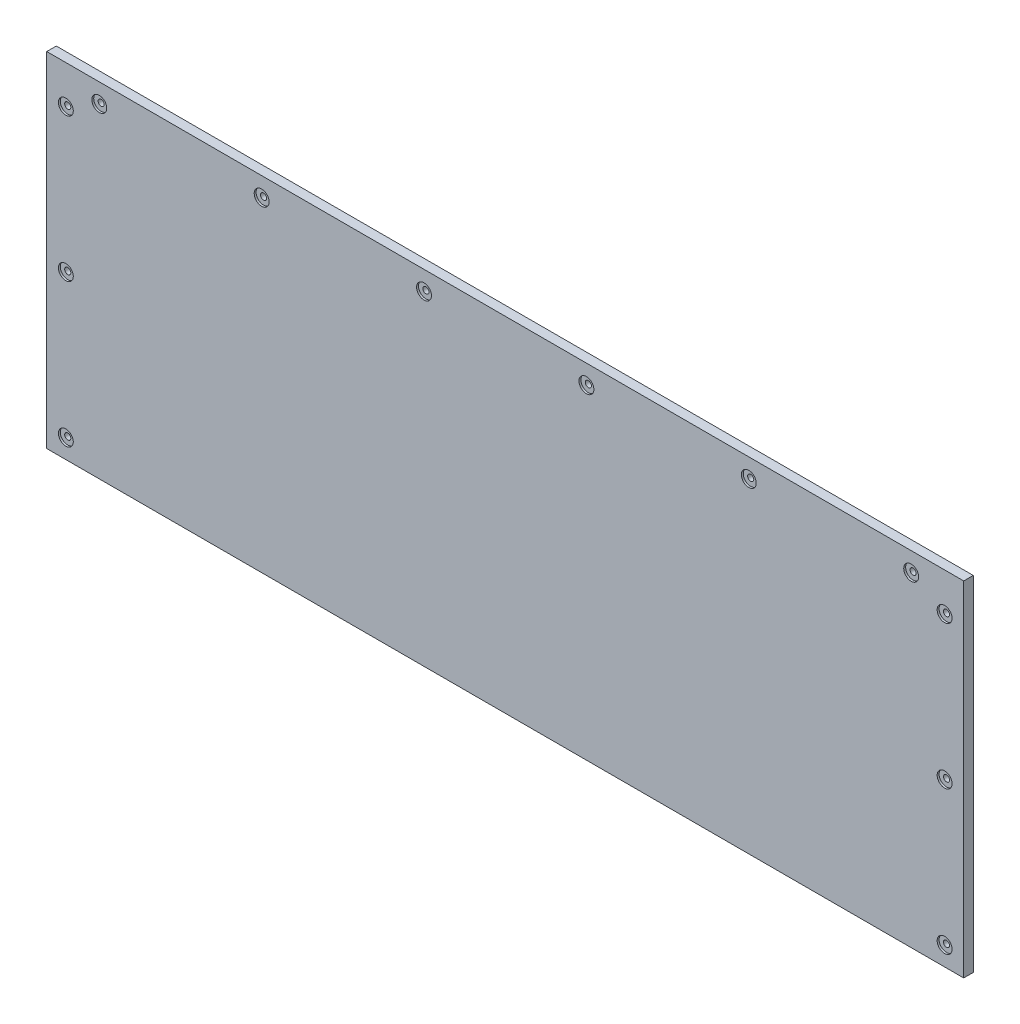
ISO-10303-21;
HEADER;
FILE_DESCRIPTION(('STEP AP214'),'2;1');
FILE_NAME('part.step','',(''),(''),'','','');
FILE_SCHEMA(('AUTOMOTIVE_DESIGN { 1 0 10303 214 1 1 1 1 }'));
ENDSEC;
DATA;
#1=APPLICATION_CONTEXT('core data for automotive mechanical design processes');
#2=APPLICATION_PROTOCOL_DEFINITION('international standard','automotive_design',2000,#1);
#3=PRODUCT_CONTEXT('',#1,'mechanical');
#4=PRODUCT('Part','Part','',(#3));
#5=PRODUCT_RELATED_PRODUCT_CATEGORY('part','',(#4));
#6=PRODUCT_DEFINITION_FORMATION('','',#4);
#7=PRODUCT_DEFINITION_CONTEXT('part definition',#1,'design');
#8=PRODUCT_DEFINITION('design','',#6,#7);
#9=PRODUCT_DEFINITION_SHAPE('','',#8);
#10=(LENGTH_UNIT() NAMED_UNIT(*) SI_UNIT(.MILLI.,.METRE.));
#11=(NAMED_UNIT(*) PLANE_ANGLE_UNIT() SI_UNIT($,.RADIAN.));
#12=(NAMED_UNIT(*) SI_UNIT($,.STERADIAN.) SOLID_ANGLE_UNIT());
#13=UNCERTAINTY_MEASURE_WITH_UNIT(LENGTH_MEASURE(1.E-05),#10,'distance_accuracy_value','');
#14=(GEOMETRIC_REPRESENTATION_CONTEXT(3) GLOBAL_UNCERTAINTY_ASSIGNED_CONTEXT((#13)) GLOBAL_UNIT_ASSIGNED_CONTEXT((#10,
#11,#12)) REPRESENTATION_CONTEXT('',''));
#15=CARTESIAN_POINT('',(0.,0.,0.));
#16=DIRECTION('',(0.,0.,1.));
#17=DIRECTION('',(1.,0.,0.));
#18=AXIS2_PLACEMENT_3D('',#15,#16,#17);
#19=CARTESIAN_POINT('',(574.675,215.9,0.));
#20=DIRECTION('',(0.,0.,1.));
#21=DIRECTION('',(1.,0.,0.));
#22=AXIS2_PLACEMENT_3D('',#19,#20,#21);
#23=CYLINDRICAL_SURFACE('',#22,2.03200000000001);
#24=CARTESIAN_POINT('',(574.675,215.9,0.));
#25=DIRECTION('',(0.,0.,1.));
#26=DIRECTION('',(1.,0.,0.));
#27=AXIS2_PLACEMENT_3D('',#24,#25,#26);
#28=CIRCLE('',#27,2.03200000000001);
#29=CARTESIAN_POINT('',(576.707,215.9,0.));
#30=VERTEX_POINT('',#29);
#31=EDGE_CURVE('E151',#30,#30,#28,.T.);
#32=ORIENTED_EDGE('',*,*,#31,.F.);
#33=EDGE_LOOP('',(#32));
#34=FACE_BOUND('',#33,.T.);
#35=CARTESIAN_POINT('',(574.675,215.9,5.08));
#36=DIRECTION('',(0.,0.,1.));
#37=DIRECTION('',(1.,0.,0.));
#38=AXIS2_PLACEMENT_3D('',#35,#36,#37);
#39=CIRCLE('',#38,2.03200000000001);
#40=CARTESIAN_POINT('',(576.707,215.9,5.08));
#41=VERTEX_POINT('',#40);
#42=EDGE_CURVE('E40',#41,#41,#39,.F.);
#43=ORIENTED_EDGE('',*,*,#42,.F.);
#44=EDGE_LOOP('',(#43));
#45=FACE_BOUND('',#44,.T.);
#46=ADVANCED_FACE('F36',(#34,#45),#23,.F.);
#47=CARTESIAN_POINT('',(466.725,215.9,0.));
#48=DIRECTION('',(0.,0.,1.));
#49=DIRECTION('',(1.,0.,0.));
#50=AXIS2_PLACEMENT_3D('',#47,#48,#49);
#51=CYLINDRICAL_SURFACE('',#50,2.03199999999995);
#52=CARTESIAN_POINT('',(466.725,215.9,0.));
#53=DIRECTION('',(0.,0.,1.));
#54=DIRECTION('',(1.,0.,0.));
#55=AXIS2_PLACEMENT_3D('',#52,#53,#54);
#56=CIRCLE('',#55,2.03199999999995);
#57=CARTESIAN_POINT('',(468.757,215.9,0.));
#58=VERTEX_POINT('',#57);
#59=EDGE_CURVE('E155',#58,#58,#56,.T.);
#60=ORIENTED_EDGE('',*,*,#59,.F.);
#61=EDGE_LOOP('',(#60));
#62=FACE_BOUND('',#61,.T.);
#63=CARTESIAN_POINT('',(466.725,215.9,5.08));
#64=DIRECTION('',(0.,0.,1.));
#65=DIRECTION('',(1.,0.,0.));
#66=AXIS2_PLACEMENT_3D('',#63,#64,#65);
#67=CIRCLE('',#66,2.03199999999995);
#68=CARTESIAN_POINT('',(468.757,215.9,5.08));
#69=VERTEX_POINT('',#68);
#70=EDGE_CURVE('E146',#69,#69,#67,.F.);
#71=ORIENTED_EDGE('',*,*,#70,.F.);
#72=EDGE_LOOP('',(#71));
#73=FACE_BOUND('',#72,.T.);
#74=ADVANCED_FACE('F246',(#62,#73),#51,.F.);
#75=CARTESIAN_POINT('',(358.775,215.9,0.));
#76=DIRECTION('',(0.,0.,1.));
#77=DIRECTION('',(1.,0.,0.));
#78=AXIS2_PLACEMENT_3D('',#75,#76,#77);
#79=CYLINDRICAL_SURFACE('',#78,2.03199999999995);
#80=CARTESIAN_POINT('',(358.775,215.9,0.));
#81=DIRECTION('',(0.,0.,1.));
#82=DIRECTION('',(1.,0.,0.));
#83=AXIS2_PLACEMENT_3D('',#80,#81,#82);
#84=CIRCLE('',#83,2.03199999999995);
#85=CARTESIAN_POINT('',(360.807,215.9,0.));
#86=VERTEX_POINT('',#85);
#87=EDGE_CURVE('E160',#86,#86,#84,.T.);
#88=ORIENTED_EDGE('',*,*,#87,.F.);
#89=EDGE_LOOP('',(#88));
#90=FACE_BOUND('',#89,.T.);
#91=CARTESIAN_POINT('',(358.775,215.9,5.08));
#92=DIRECTION('',(0.,0.,1.));
#93=DIRECTION('',(1.,0.,0.));
#94=AXIS2_PLACEMENT_3D('',#91,#92,#93);
#95=CIRCLE('',#94,2.03199999999995);
#96=CARTESIAN_POINT('',(360.807,215.9,5.08));
#97=VERTEX_POINT('',#96);
#98=EDGE_CURVE('E144',#97,#97,#95,.F.);
#99=ORIENTED_EDGE('',*,*,#98,.F.);
#100=EDGE_LOOP('',(#99));
#101=FACE_BOUND('',#100,.T.);
#102=ADVANCED_FACE('F252',(#90,#101),#79,.F.);
#103=CARTESIAN_POINT('',(250.825,215.9,0.));
#104=DIRECTION('',(0.,0.,1.));
#105=DIRECTION('',(1.,0.,0.));
#106=AXIS2_PLACEMENT_3D('',#103,#104,#105);
#107=CYLINDRICAL_SURFACE('',#106,2.03199999999995);
#108=CARTESIAN_POINT('',(250.825,215.9,0.));
#109=DIRECTION('',(0.,0.,1.));
#110=DIRECTION('',(1.,0.,0.));
#111=AXIS2_PLACEMENT_3D('',#108,#109,#110);
#112=CIRCLE('',#111,2.03199999999995);
#113=CARTESIAN_POINT('',(252.857,215.9,0.));
#114=VERTEX_POINT('',#113);
#115=EDGE_CURVE('E660',#114,#114,#112,.T.);
#116=ORIENTED_EDGE('',*,*,#115,.F.);
#117=EDGE_LOOP('',(#116));
#118=FACE_BOUND('',#117,.T.);
#119=CARTESIAN_POINT('',(250.825,215.9,5.08));
#120=DIRECTION('',(0.,0.,1.));
#121=DIRECTION('',(1.,0.,0.));
#122=AXIS2_PLACEMENT_3D('',#119,#120,#121);
#123=CIRCLE('',#122,2.03199999999995);
#124=CARTESIAN_POINT('',(252.857,215.9,5.08));
#125=VERTEX_POINT('',#124);
#126=EDGE_CURVE('E141',#125,#125,#123,.F.);
#127=ORIENTED_EDGE('',*,*,#126,.F.);
#128=EDGE_LOOP('',(#127));
#129=FACE_BOUND('',#128,.T.);
#130=ADVANCED_FACE('F492',(#118,#129),#107,.F.);
#131=CARTESIAN_POINT('',(142.875,215.9,0.));
#132=DIRECTION('',(0.,0.,1.));
#133=DIRECTION('',(1.,0.,0.));
#134=AXIS2_PLACEMENT_3D('',#131,#132,#133);
#135=CYLINDRICAL_SURFACE('',#134,2.032);
#136=CARTESIAN_POINT('',(142.875,215.9,0.));
#137=DIRECTION('',(0.,0.,1.));
#138=DIRECTION('',(1.,0.,0.));
#139=AXIS2_PLACEMENT_3D('',#136,#137,#138);
#140=CIRCLE('',#139,2.032);
#141=CARTESIAN_POINT('',(144.907,215.9,0.));
#142=VERTEX_POINT('',#141);
#143=EDGE_CURVE('E657',#142,#142,#140,.T.);
#144=ORIENTED_EDGE('',*,*,#143,.F.);
#145=EDGE_LOOP('',(#144));
#146=FACE_BOUND('',#145,.T.);
#147=CARTESIAN_POINT('',(142.875,215.9,5.08));
#148=DIRECTION('',(0.,0.,1.));
#149=DIRECTION('',(1.,0.,0.));
#150=AXIS2_PLACEMENT_3D('',#147,#148,#149);
#151=CIRCLE('',#150,2.032);
#152=CARTESIAN_POINT('',(144.907,215.9,5.08));
#153=VERTEX_POINT('',#152);
#154=EDGE_CURVE('E137',#153,#153,#151,.F.);
#155=ORIENTED_EDGE('',*,*,#154,.F.);
#156=EDGE_LOOP('',(#155));
#157=FACE_BOUND('',#156,.T.);
#158=ADVANCED_FACE('F501',(#146,#157),#135,.F.);
#159=CARTESIAN_POINT('',(34.925,215.9,0.));
#160=DIRECTION('',(0.,0.,1.));
#161=DIRECTION('',(1.,0.,0.));
#162=AXIS2_PLACEMENT_3D('',#159,#160,#161);
#163=CYLINDRICAL_SURFACE('',#162,2.032);
#164=CARTESIAN_POINT('',(34.925,215.9,0.));
#165=DIRECTION('',(0.,0.,1.));
#166=DIRECTION('',(1.,0.,0.));
#167=AXIS2_PLACEMENT_3D('',#164,#165,#166);
#168=CIRCLE('',#167,2.032);
#169=CARTESIAN_POINT('',(36.957,215.9,0.));
#170=VERTEX_POINT('',#169);
#171=EDGE_CURVE('E195',#170,#170,#168,.T.);
#172=ORIENTED_EDGE('',*,*,#171,.F.);
#173=EDGE_LOOP('',(#172));
#174=FACE_BOUND('',#173,.T.);
#175=CARTESIAN_POINT('',(34.925,215.9,5.08));
#176=DIRECTION('',(0.,0.,1.));
#177=DIRECTION('',(1.,0.,0.));
#178=AXIS2_PLACEMENT_3D('',#175,#176,#177);
#179=CIRCLE('',#178,2.032);
#180=CARTESIAN_POINT('',(36.957,215.9,5.08));
#181=VERTEX_POINT('',#180);
#182=EDGE_CURVE('E134',#181,#181,#179,.F.);
#183=ORIENTED_EDGE('',*,*,#182,.F.);
#184=EDGE_LOOP('',(#183));
#185=FACE_BOUND('',#184,.T.);
#186=ADVANCED_FACE('F224',(#174,#185),#163,.F.);
#187=CARTESIAN_POINT('',(12.7,203.2,0.));
#188=DIRECTION('',(0.,0.,1.));
#189=DIRECTION('',(1.,0.,0.));
#190=AXIS2_PLACEMENT_3D('',#187,#188,#189);
#191=CYLINDRICAL_SURFACE('',#190,2.032);
#192=CARTESIAN_POINT('',(12.7,203.2,0.));
#193=DIRECTION('',(0.,0.,1.));
#194=DIRECTION('',(1.,0.,0.));
#195=AXIS2_PLACEMENT_3D('',#192,#193,#194);
#196=CIRCLE('',#195,2.032);
#197=CARTESIAN_POINT('',(14.732,203.2,0.));
#198=VERTEX_POINT('',#197);
#199=EDGE_CURVE('E105',#198,#198,#196,.T.);
#200=ORIENTED_EDGE('',*,*,#199,.F.);
#201=EDGE_LOOP('',(#200));
#202=FACE_BOUND('',#201,.T.);
#203=CARTESIAN_POINT('',(12.7,203.2,5.08));
#204=DIRECTION('',(0.,0.,1.));
#205=DIRECTION('',(1.,0.,0.));
#206=AXIS2_PLACEMENT_3D('',#203,#204,#205);
#207=CIRCLE('',#206,2.032);
#208=CARTESIAN_POINT('',(14.732,203.2,5.08));
#209=VERTEX_POINT('',#208);
#210=EDGE_CURVE('E130',#209,#209,#207,.F.);
#211=ORIENTED_EDGE('',*,*,#210,.F.);
#212=EDGE_LOOP('',(#211));
#213=FACE_BOUND('',#212,.T.);
#214=ADVANCED_FACE('F220',(#202,#213),#191,.F.);
#215=CARTESIAN_POINT('',(12.700000000001,107.95,0.));
#216=DIRECTION('',(0.,0.,1.));
#217=DIRECTION('',(1.,0.,0.));
#218=AXIS2_PLACEMENT_3D('',#215,#216,#217);
#219=CYLINDRICAL_SURFACE('',#218,2.032);
#220=CARTESIAN_POINT('',(12.700000000001,107.95,0.));
#221=DIRECTION('',(0.,0.,1.));
#222=DIRECTION('',(1.,0.,0.));
#223=AXIS2_PLACEMENT_3D('',#220,#221,#222);
#224=CIRCLE('',#223,2.032);
#225=CARTESIAN_POINT('',(14.732000000001,107.95,0.));
#226=VERTEX_POINT('',#225);
#227=EDGE_CURVE('E200',#226,#226,#224,.T.);
#228=ORIENTED_EDGE('',*,*,#227,.F.);
#229=EDGE_LOOP('',(#228));
#230=FACE_BOUND('',#229,.T.);
#231=CARTESIAN_POINT('',(12.700000000001,107.95,5.08));
#232=DIRECTION('',(0.,0.,1.));
#233=DIRECTION('',(1.,0.,0.));
#234=AXIS2_PLACEMENT_3D('',#231,#232,#233);
#235=CIRCLE('',#234,2.032);
#236=CARTESIAN_POINT('',(14.732000000001,107.95,5.08));
#237=VERTEX_POINT('',#236);
#238=EDGE_CURVE('E127',#237,#237,#235,.F.);
#239=ORIENTED_EDGE('',*,*,#238,.F.);
#240=EDGE_LOOP('',(#239));
#241=FACE_BOUND('',#240,.T.);
#242=ADVANCED_FACE('F223',(#230,#241),#219,.F.);
#243=CARTESIAN_POINT('',(12.700000000002,12.7,0.));
#244=DIRECTION('',(0.,0.,1.));
#245=DIRECTION('',(1.,0.,0.));
#246=AXIS2_PLACEMENT_3D('',#243,#244,#245);
#247=CYLINDRICAL_SURFACE('',#246,2.032);
#248=CARTESIAN_POINT('',(12.700000000002,12.7,0.));
#249=DIRECTION('',(0.,0.,1.));
#250=DIRECTION('',(1.,0.,0.));
#251=AXIS2_PLACEMENT_3D('',#248,#249,#250);
#252=CIRCLE('',#251,2.032);
#253=CARTESIAN_POINT('',(14.732000000002,12.7,0.));
#254=VERTEX_POINT('',#253);
#255=EDGE_CURVE('E203',#254,#254,#252,.T.);
#256=ORIENTED_EDGE('',*,*,#255,.F.);
#257=EDGE_LOOP('',(#256));
#258=FACE_BOUND('',#257,.T.);
#259=CARTESIAN_POINT('',(12.700000000002,12.7,5.08));
#260=DIRECTION('',(0.,0.,1.));
#261=DIRECTION('',(1.,0.,0.));
#262=AXIS2_PLACEMENT_3D('',#259,#260,#261);
#263=CIRCLE('',#262,2.032);
#264=CARTESIAN_POINT('',(14.732000000002,12.7,5.08));
#265=VERTEX_POINT('',#264);
#266=EDGE_CURVE('E124',#265,#265,#263,.F.);
#267=ORIENTED_EDGE('',*,*,#266,.F.);
#268=EDGE_LOOP('',(#267));
#269=FACE_BOUND('',#268,.T.);
#270=ADVANCED_FACE('F304',(#258,#269),#247,.F.);
#271=CARTESIAN_POINT('',(0.,0.,6.35));
#272=DIRECTION('',(0.,0.,1.));
#273=DIRECTION('',(1.,0.,0.));
#274=AXIS2_PLACEMENT_3D('',#271,#272,#273);
#275=PLANE('',#274);
#276=CARTESIAN_POINT('',(34.925,215.9,6.35));
#277=DIRECTION('',(0.,0.,1.));
#278=DIRECTION('',(1.,0.,0.));
#279=AXIS2_PLACEMENT_3D('',#276,#277,#278);
#280=CIRCLE('',#279,4.953);
#281=CARTESIAN_POINT('',(39.878,215.9,6.35));
#282=VERTEX_POINT('',#281);
#283=EDGE_CURVE('E713',#282,#282,#280,.T.);
#284=ORIENTED_EDGE('',*,*,#283,.F.);
#285=EDGE_LOOP('',(#284));
#286=FACE_BOUND('',#285,.T.);
#287=CARTESIAN_POINT('',(142.875,215.9,6.35));
#288=DIRECTION('',(0.,0.,1.));
#289=DIRECTION('',(1.,0.,0.));
#290=AXIS2_PLACEMENT_3D('',#287,#288,#289);
#291=CIRCLE('',#290,4.953);
#292=CARTESIAN_POINT('',(147.828,215.9,6.35));
#293=VERTEX_POINT('',#292);
#294=EDGE_CURVE('E707',#293,#293,#291,.T.);
#295=ORIENTED_EDGE('',*,*,#294,.F.);
#296=EDGE_LOOP('',(#295));
#297=FACE_BOUND('',#296,.T.);
#298=CARTESIAN_POINT('',(250.825,215.9,6.35));
#299=DIRECTION('',(0.,0.,1.));
#300=DIRECTION('',(1.,0.,0.));
#301=AXIS2_PLACEMENT_3D('',#298,#299,#300);
#302=CIRCLE('',#301,4.95299999999995);
#303=CARTESIAN_POINT('',(255.778,215.9,6.35));
#304=VERTEX_POINT('',#303);
#305=EDGE_CURVE('E701',#304,#304,#302,.T.);
#306=ORIENTED_EDGE('',*,*,#305,.F.);
#307=EDGE_LOOP('',(#306));
#308=FACE_BOUND('',#307,.T.);
#309=CARTESIAN_POINT('',(358.775,215.9,6.35));
#310=DIRECTION('',(0.,0.,1.));
#311=DIRECTION('',(1.,0.,0.));
#312=AXIS2_PLACEMENT_3D('',#309,#310,#311);
#313=CIRCLE('',#312,4.95299999999995);
#314=CARTESIAN_POINT('',(363.728,215.9,6.35));
#315=VERTEX_POINT('',#314);
#316=EDGE_CURVE('E695',#315,#315,#313,.T.);
#317=ORIENTED_EDGE('',*,*,#316,.F.);
#318=EDGE_LOOP('',(#317));
#319=FACE_BOUND('',#318,.T.);
#320=CARTESIAN_POINT('',(466.725,215.9,6.35));
#321=DIRECTION('',(0.,0.,1.));
#322=DIRECTION('',(1.,0.,0.));
#323=AXIS2_PLACEMENT_3D('',#320,#321,#322);
#324=CIRCLE('',#323,4.95299999999995);
#325=CARTESIAN_POINT('',(471.678,215.9,6.35));
#326=VERTEX_POINT('',#325);
#327=EDGE_CURVE('E651',#326,#326,#324,.T.);
#328=ORIENTED_EDGE('',*,*,#327,.F.);
#329=EDGE_LOOP('',(#328));
#330=FACE_BOUND('',#329,.T.);
#331=CARTESIAN_POINT('',(574.675,215.9,6.35));
#332=DIRECTION('',(0.,0.,1.));
#333=DIRECTION('',(1.,0.,0.));
#334=AXIS2_PLACEMENT_3D('',#331,#332,#333);
#335=CIRCLE('',#334,4.95299999999995);
#336=CARTESIAN_POINT('',(579.628,215.9,6.35));
#337=VERTEX_POINT('',#336);
#338=EDGE_CURVE('E648',#337,#337,#335,.T.);
#339=ORIENTED_EDGE('',*,*,#338,.F.);
#340=EDGE_LOOP('',(#339));
#341=FACE_BOUND('',#340,.T.);
#342=CARTESIAN_POINT('',(596.9,203.2,6.35));
#343=DIRECTION('',(0.,0.,1.));
#344=DIRECTION('',(-1.,0.,0.));
#345=AXIS2_PLACEMENT_3D('',#342,#343,#344);
#346=CIRCLE('',#345,4.95300000000006);
#347=CARTESIAN_POINT('',(591.947,203.2,6.35));
#348=VERTEX_POINT('',#347);
#349=EDGE_CURVE('E192',#348,#348,#346,.T.);
#350=ORIENTED_EDGE('',*,*,#349,.F.);
#351=EDGE_LOOP('',(#350));
#352=FACE_BOUND('',#351,.T.);
#353=CARTESIAN_POINT('',(596.899999999999,107.95,6.35));
#354=DIRECTION('',(0.,0.,1.));
#355=DIRECTION('',(-1.,0.,0.));
#356=AXIS2_PLACEMENT_3D('',#353,#354,#355);
#357=CIRCLE('',#356,4.95300000000006);
#358=CARTESIAN_POINT('',(591.946999999999,107.95,6.35));
#359=VERTEX_POINT('',#358);
#360=EDGE_CURVE('E186',#359,#359,#357,.T.);
#361=ORIENTED_EDGE('',*,*,#360,.F.);
#362=EDGE_LOOP('',(#361));
#363=FACE_BOUND('',#362,.T.);
#364=CARTESIAN_POINT('',(596.899999999998,12.7,6.35));
#365=DIRECTION('',(0.,0.,1.));
#366=DIRECTION('',(-1.,0.,0.));
#367=AXIS2_PLACEMENT_3D('',#364,#365,#366);
#368=CIRCLE('',#367,4.95300000000006);
#369=CARTESIAN_POINT('',(591.946999999998,12.7,6.35));
#370=VERTEX_POINT('',#369);
#371=EDGE_CURVE('E180',#370,#370,#368,.T.);
#372=ORIENTED_EDGE('',*,*,#371,.F.);
#373=EDGE_LOOP('',(#372));
#374=FACE_BOUND('',#373,.T.);
#375=CARTESIAN_POINT('',(12.700000000002,12.7,6.35));
#376=DIRECTION('',(0.,0.,1.));
#377=DIRECTION('',(1.,0.,0.));
#378=AXIS2_PLACEMENT_3D('',#375,#376,#377);
#379=CIRCLE('',#378,4.953);
#380=CARTESIAN_POINT('',(17.653000000002,12.7,6.35));
#381=VERTEX_POINT('',#380);
#382=EDGE_CURVE('E174',#381,#381,#379,.T.);
#383=ORIENTED_EDGE('',*,*,#382,.F.);
#384=EDGE_LOOP('',(#383));
#385=FACE_BOUND('',#384,.T.);
#386=CARTESIAN_POINT('',(12.700000000001,107.95,6.35));
#387=DIRECTION('',(0.,0.,1.));
#388=DIRECTION('',(1.,0.,0.));
#389=AXIS2_PLACEMENT_3D('',#386,#387,#388);
#390=CIRCLE('',#389,4.953);
#391=CARTESIAN_POINT('',(17.653000000001,107.95,6.35));
#392=VERTEX_POINT('',#391);
#393=EDGE_CURVE('E168',#392,#392,#390,.T.);
#394=ORIENTED_EDGE('',*,*,#393,.F.);
#395=EDGE_LOOP('',(#394));
#396=FACE_BOUND('',#395,.T.);
#397=CARTESIAN_POINT('',(12.7,203.2,6.35));
#398=DIRECTION('',(0.,0.,1.));
#399=DIRECTION('',(1.,0.,0.));
#400=AXIS2_PLACEMENT_3D('',#397,#398,#399);
#401=CIRCLE('',#400,4.953);
#402=CARTESIAN_POINT('',(17.653,203.2,6.35));
#403=VERTEX_POINT('',#402);
#404=EDGE_CURVE('E167',#403,#403,#401,.T.);
#405=ORIENTED_EDGE('',*,*,#404,.F.);
#406=EDGE_LOOP('',(#405));
#407=FACE_BOUND('',#406,.T.);
#408=DIRECTION('',(1.,0.,0.));
#409=VECTOR('',#408,1.);
#410=CARTESIAN_POINT('',(0.,0.,6.35));
#411=LINE('',#410,#409);
#412=CARTESIAN_POINT('',(0.,0.,6.35));
#413=VERTEX_POINT('',#412);
#414=CARTESIAN_POINT('',(609.6,0.,6.35));
#415=VERTEX_POINT('',#414);
#416=EDGE_CURVE('E88',#413,#415,#411,.T.);
#417=ORIENTED_EDGE('',*,*,#416,.T.);
#418=DIRECTION('',(0.,1.,0.));
#419=VECTOR('',#418,1.);
#420=CARTESIAN_POINT('',(609.6,0.,6.35));
#421=LINE('',#420,#419);
#422=CARTESIAN_POINT('',(609.6,228.6,6.35));
#423=VERTEX_POINT('',#422);
#424=EDGE_CURVE('E80',#415,#423,#421,.T.);
#425=ORIENTED_EDGE('',*,*,#424,.T.);
#426=DIRECTION('',(1.,0.,0.));
#427=VECTOR('',#426,1.);
#428=CARTESIAN_POINT('',(0.,228.6,6.35));
#429=LINE('',#428,#427);
#430=CARTESIAN_POINT('',(0.,228.6,6.35));
#431=VERTEX_POINT('',#430);
#432=EDGE_CURVE('E87',#431,#423,#429,.T.);
#433=ORIENTED_EDGE('',*,*,#432,.F.);
#434=DIRECTION('',(0.,1.,0.));
#435=VECTOR('',#434,1.);
#436=CARTESIAN_POINT('',(0.,0.,6.35));
#437=LINE('',#436,#435);
#438=EDGE_CURVE('E98',#413,#431,#437,.T.);
#439=ORIENTED_EDGE('',*,*,#438,.F.);
#440=EDGE_LOOP('',(#417,#425,#433,#439));
#441=FACE_BOUND('',#440,.T.);
#442=ADVANCED_FACE('F84',(#286,#297,#308,#319,#330,#341,#352,#363,#374,#385,#396,#407,#441),
#275,.T.);
#443=CARTESIAN_POINT('',(0.,0.,0.));
#444=DIRECTION('',(0.,0.,1.));
#445=DIRECTION('',(1.,0.,0.));
#446=AXIS2_PLACEMENT_3D('',#443,#444,#445);
#447=PLANE('',#446);
#448=ORIENTED_EDGE('',*,*,#171,.T.);
#449=EDGE_LOOP('',(#448));
#450=FACE_BOUND('',#449,.T.);
#451=ORIENTED_EDGE('',*,*,#143,.T.);
#452=EDGE_LOOP('',(#451));
#453=FACE_BOUND('',#452,.T.);
#454=ORIENTED_EDGE('',*,*,#115,.T.);
#455=EDGE_LOOP('',(#454));
#456=FACE_BOUND('',#455,.T.);
#457=ORIENTED_EDGE('',*,*,#87,.T.);
#458=EDGE_LOOP('',(#457));
#459=FACE_BOUND('',#458,.T.);
#460=ORIENTED_EDGE('',*,*,#59,.T.);
#461=EDGE_LOOP('',(#460));
#462=FACE_BOUND('',#461,.T.);
#463=ORIENTED_EDGE('',*,*,#31,.T.);
#464=EDGE_LOOP('',(#463));
#465=FACE_BOUND('',#464,.T.);
#466=ORIENTED_EDGE('',*,*,#255,.T.);
#467=EDGE_LOOP('',(#466));
#468=FACE_BOUND('',#467,.T.);
#469=ORIENTED_EDGE('',*,*,#227,.T.);
#470=EDGE_LOOP('',(#469));
#471=FACE_BOUND('',#470,.T.);
#472=ORIENTED_EDGE('',*,*,#199,.T.);
#473=EDGE_LOOP('',(#472));
#474=FACE_BOUND('',#473,.T.);
#475=DIRECTION('',(1.,0.,0.));
#476=VECTOR('',#475,1.);
#477=CARTESIAN_POINT('',(0.,0.,0.));
#478=LINE('',#477,#476);
#479=CARTESIAN_POINT('',(0.,0.,0.));
#480=VERTEX_POINT('',#479);
#481=CARTESIAN_POINT('',(609.6,0.,0.));
#482=VERTEX_POINT('',#481);
#483=EDGE_CURVE('E103',#480,#482,#478,.T.);
#484=ORIENTED_EDGE('',*,*,#483,.F.);
#485=DIRECTION('',(0.,1.,0.));
#486=VECTOR('',#485,1.);
#487=CARTESIAN_POINT('',(0.,0.,0.));
#488=LINE('',#487,#486);
#489=CARTESIAN_POINT('',(0.,228.6,0.));
#490=VERTEX_POINT('',#489);
#491=EDGE_CURVE('E109',#480,#490,#488,.T.);
#492=ORIENTED_EDGE('',*,*,#491,.T.);
#493=DIRECTION('',(1.,0.,0.));
#494=VECTOR('',#493,1.);
#495=CARTESIAN_POINT('',(0.,228.6,0.));
#496=LINE('',#495,#494);
#497=CARTESIAN_POINT('',(609.6,228.6,0.));
#498=VERTEX_POINT('',#497);
#499=EDGE_CURVE('E107',#490,#498,#496,.T.);
#500=ORIENTED_EDGE('',*,*,#499,.T.);
#501=DIRECTION('',(0.,1.,0.));
#502=VECTOR('',#501,1.);
#503=CARTESIAN_POINT('',(609.6,0.,0.));
#504=LINE('',#503,#502);
#505=EDGE_CURVE('E93',#482,#498,#504,.T.);
#506=ORIENTED_EDGE('',*,*,#505,.F.);
#507=EDGE_LOOP('',(#484,#492,#500,#506));
#508=FACE_BOUND('',#507,.T.);
#509=CARTESIAN_POINT('',(596.899999999998,12.7,0.));
#510=DIRECTION('',(0.,0.,-1.));
#511=DIRECTION('',(-1.,0.,0.));
#512=AXIS2_PLACEMENT_3D('',#509,#510,#511);
#513=CIRCLE('',#512,2.03200000000011);
#514=CARTESIAN_POINT('',(594.867999999998,12.7,0.));
#515=VERTEX_POINT('',#514);
#516=EDGE_CURVE('E206',#515,#515,#513,.T.);
#517=ORIENTED_EDGE('',*,*,#516,.F.);
#518=EDGE_LOOP('',(#517));
#519=FACE_BOUND('',#518,.T.);
#520=CARTESIAN_POINT('',(596.899999999999,107.95,0.));
#521=DIRECTION('',(0.,0.,-1.));
#522=DIRECTION('',(-1.,0.,0.));
#523=AXIS2_PLACEMENT_3D('',#520,#521,#522);
#524=CIRCLE('',#523,2.032);
#525=CARTESIAN_POINT('',(594.867999999999,107.95,0.));
#526=VERTEX_POINT('',#525);
#527=EDGE_CURVE('E209',#526,#526,#524,.T.);
#528=ORIENTED_EDGE('',*,*,#527,.F.);
#529=EDGE_LOOP('',(#528));
#530=FACE_BOUND('',#529,.T.);
#531=CARTESIAN_POINT('',(596.9,203.2,0.));
#532=DIRECTION('',(0.,0.,-1.));
#533=DIRECTION('',(-1.,0.,0.));
#534=AXIS2_PLACEMENT_3D('',#531,#532,#533);
#535=CIRCLE('',#534,2.032);
#536=CARTESIAN_POINT('',(594.868,203.2,0.));
#537=VERTEX_POINT('',#536);
#538=EDGE_CURVE('E133',#537,#537,#535,.T.);
#539=ORIENTED_EDGE('',*,*,#538,.F.);
#540=EDGE_LOOP('',(#539));
#541=FACE_BOUND('',#540,.T.);
#542=ADVANCED_FACE('F217',(#450,#453,#456,#459,#462,#465,#468,#471,#474,#508,#519,#530,#541),
#447,.F.);
#543=CARTESIAN_POINT('',(0.,0.,6.35));
#544=DIRECTION('',(0.,1.,0.));
#545=DIRECTION('',(0.,0.,1.));
#546=AXIS2_PLACEMENT_3D('',#543,#544,#545);
#547=PLANE('',#546);
#548=ORIENTED_EDGE('',*,*,#483,.T.);
#549=DIRECTION('',(0.,0.,-1.));
#550=VECTOR('',#549,1.);
#551=CARTESIAN_POINT('',(609.6,0.,6.35));
#552=LINE('',#551,#550);
#553=EDGE_CURVE('E11',#415,#482,#552,.T.);
#554=ORIENTED_EDGE('',*,*,#553,.F.);
#555=ORIENTED_EDGE('',*,*,#416,.F.);
#556=DIRECTION('',(0.,0.,-1.));
#557=VECTOR('',#556,1.);
#558=CARTESIAN_POINT('',(0.,0.,6.35));
#559=LINE('',#558,#557);
#560=EDGE_CURVE('E55',#413,#480,#559,.T.);
#561=ORIENTED_EDGE('',*,*,#560,.T.);
#562=EDGE_LOOP('',(#548,#554,#555,#561));
#563=FACE_BOUND('',#562,.T.);
#564=ADVANCED_FACE('F38',(#563),#547,.F.);
#565=CARTESIAN_POINT('',(609.6,0.,6.35));
#566=DIRECTION('',(-1.,0.,0.));
#567=DIRECTION('',(0.,0.,1.));
#568=AXIS2_PLACEMENT_3D('',#565,#566,#567);
#569=PLANE('',#568);
#570=ORIENTED_EDGE('',*,*,#505,.T.);
#571=DIRECTION('',(0.,0.,-1.));
#572=VECTOR('',#571,1.);
#573=CARTESIAN_POINT('',(609.6,228.6,6.35));
#574=LINE('',#573,#572);
#575=EDGE_CURVE('E46',#423,#498,#574,.T.);
#576=ORIENTED_EDGE('',*,*,#575,.F.);
#577=ORIENTED_EDGE('',*,*,#424,.F.);
#578=ORIENTED_EDGE('',*,*,#553,.T.);
#579=EDGE_LOOP('',(#570,#576,#577,#578));
#580=FACE_BOUND('',#579,.T.);
#581=ADVANCED_FACE('F92',(#580),#569,.F.);
#582=CARTESIAN_POINT('',(0.,228.6,6.35));
#583=DIRECTION('',(0.,1.,0.));
#584=DIRECTION('',(0.,0.,1.));
#585=AXIS2_PLACEMENT_3D('',#582,#583,#584);
#586=PLANE('',#585);
#587=ORIENTED_EDGE('',*,*,#499,.F.);
#588=DIRECTION('',(0.,0.,-1.));
#589=VECTOR('',#588,1.);
#590=CARTESIAN_POINT('',(0.,228.6,6.35));
#591=LINE('',#590,#589);
#592=EDGE_CURVE('E69',#431,#490,#591,.T.);
#593=ORIENTED_EDGE('',*,*,#592,.F.);
#594=ORIENTED_EDGE('',*,*,#432,.T.);
#595=ORIENTED_EDGE('',*,*,#575,.T.);
#596=EDGE_LOOP('',(#587,#593,#594,#595));
#597=FACE_BOUND('',#596,.T.);
#598=ADVANCED_FACE('F97',(#597),#586,.T.);
#599=CARTESIAN_POINT('',(0.,0.,6.35));
#600=DIRECTION('',(-1.,0.,0.));
#601=DIRECTION('',(0.,0.,1.));
#602=AXIS2_PLACEMENT_3D('',#599,#600,#601);
#603=PLANE('',#602);
#604=ORIENTED_EDGE('',*,*,#491,.F.);
#605=ORIENTED_EDGE('',*,*,#560,.F.);
#606=ORIENTED_EDGE('',*,*,#438,.T.);
#607=ORIENTED_EDGE('',*,*,#592,.T.);
#608=EDGE_LOOP('',(#604,#605,#606,#607));
#609=FACE_BOUND('',#608,.T.);
#610=ADVANCED_FACE('F332',(#609),#603,.T.);
#611=CARTESIAN_POINT('',(596.899999999998,12.7,0.));
#612=DIRECTION('',(0.,0.,1.));
#613=DIRECTION('',(1.,0.,0.));
#614=AXIS2_PLACEMENT_3D('',#611,#612,#613);
#615=CYLINDRICAL_SURFACE('',#614,2.03200000000011);
#616=CARTESIAN_POINT('',(596.899999999998,12.7,5.08));
#617=DIRECTION('',(0.,0.,-1.));
#618=DIRECTION('',(-1.,0.,0.));
#619=AXIS2_PLACEMENT_3D('',#616,#617,#618);
#620=CIRCLE('',#619,2.03200000000011);
#621=CARTESIAN_POINT('',(594.867999999998,12.7,5.08));
#622=VERTEX_POINT('',#621);
#623=EDGE_CURVE('E121',#622,#622,#620,.T.);
#624=ORIENTED_EDGE('',*,*,#623,.F.);
#625=EDGE_LOOP('',(#624));
#626=FACE_BOUND('',#625,.T.);
#627=ORIENTED_EDGE('',*,*,#516,.T.);
#628=EDGE_LOOP('',(#627));
#629=FACE_BOUND('',#628,.T.);
#630=ADVANCED_FACE('F335',(#626,#629),#615,.F.);
#631=CARTESIAN_POINT('',(596.899999999999,107.95,0.));
#632=DIRECTION('',(0.,0.,1.));
#633=DIRECTION('',(1.,0.,0.));
#634=AXIS2_PLACEMENT_3D('',#631,#632,#633);
#635=CYLINDRICAL_SURFACE('',#634,2.032);
#636=CARTESIAN_POINT('',(596.899999999999,107.95,5.08));
#637=DIRECTION('',(0.,0.,-1.));
#638=DIRECTION('',(-1.,0.,0.));
#639=AXIS2_PLACEMENT_3D('',#636,#637,#638);
#640=CIRCLE('',#639,2.032);
#641=CARTESIAN_POINT('',(594.867999999999,107.95,5.08));
#642=VERTEX_POINT('',#641);
#643=EDGE_CURVE('E117',#642,#642,#640,.T.);
#644=ORIENTED_EDGE('',*,*,#643,.F.);
#645=EDGE_LOOP('',(#644));
#646=FACE_BOUND('',#645,.T.);
#647=ORIENTED_EDGE('',*,*,#527,.T.);
#648=EDGE_LOOP('',(#647));
#649=FACE_BOUND('',#648,.T.);
#650=ADVANCED_FACE('F295',(#646,#649),#635,.F.);
#651=CARTESIAN_POINT('',(596.9,203.2,0.));
#652=DIRECTION('',(0.,0.,1.));
#653=DIRECTION('',(1.,0.,0.));
#654=AXIS2_PLACEMENT_3D('',#651,#652,#653);
#655=CYLINDRICAL_SURFACE('',#654,2.032);
#656=CARTESIAN_POINT('',(596.9,203.2,5.08));
#657=DIRECTION('',(0.,0.,-1.));
#658=DIRECTION('',(-1.,0.,0.));
#659=AXIS2_PLACEMENT_3D('',#656,#657,#658);
#660=CIRCLE('',#659,2.032);
#661=CARTESIAN_POINT('',(594.868,203.2,5.08));
#662=VERTEX_POINT('',#661);
#663=EDGE_CURVE('E114',#662,#662,#660,.T.);
#664=ORIENTED_EDGE('',*,*,#663,.F.);
#665=EDGE_LOOP('',(#664));
#666=FACE_BOUND('',#665,.T.);
#667=ORIENTED_EDGE('',*,*,#538,.T.);
#668=EDGE_LOOP('',(#667));
#669=FACE_BOUND('',#668,.T.);
#670=ADVANCED_FACE('F290',(#666,#669),#655,.F.);
#671=CARTESIAN_POINT('',(596.9,203.2,5.08));
#672=DIRECTION('',(0.,0.,1.));
#673=DIRECTION('',(1.,0.,0.));
#674=AXIS2_PLACEMENT_3D('',#671,#672,#673);
#675=CYLINDRICAL_SURFACE('',#674,4.95300000000006);
#676=CARTESIAN_POINT('',(596.9,203.2,5.08));
#677=DIRECTION('',(0.,0.,1.));
#678=DIRECTION('',(-1.,0.,0.));
#679=AXIS2_PLACEMENT_3D('',#676,#677,#678);
#680=CIRCLE('',#679,4.95300000000006);
#681=CARTESIAN_POINT('',(591.947,203.2,5.08));
#682=VERTEX_POINT('',#681);
#683=EDGE_CURVE('E189',#682,#682,#680,.T.);
#684=ORIENTED_EDGE('',*,*,#683,.F.);
#685=EDGE_LOOP('',(#684));
#686=FACE_BOUND('',#685,.T.);
#687=ORIENTED_EDGE('',*,*,#349,.T.);
#688=EDGE_LOOP('',(#687));
#689=FACE_BOUND('',#688,.T.);
#690=ADVANCED_FACE('F287',(#686,#689),#675,.F.);
#691=CARTESIAN_POINT('',(596.9,203.2,5.08));
#692=DIRECTION('',(0.,0.,-1.));
#693=DIRECTION('',(-1.,0.,0.));
#694=AXIS2_PLACEMENT_3D('',#691,#692,#693);
#695=PLANE('',#694);
#696=ORIENTED_EDGE('',*,*,#663,.T.);
#697=EDGE_LOOP('',(#696));
#698=FACE_BOUND('',#697,.T.);
#699=ORIENTED_EDGE('',*,*,#683,.T.);
#700=EDGE_LOOP('',(#699));
#701=FACE_BOUND('',#700,.T.);
#702=ADVANCED_FACE('F284',(#698,#701),#695,.F.);
#703=CARTESIAN_POINT('',(596.899999999999,107.95,5.08));
#704=DIRECTION('',(0.,0.,1.));
#705=DIRECTION('',(1.,0.,0.));
#706=AXIS2_PLACEMENT_3D('',#703,#704,#705);
#707=CYLINDRICAL_SURFACE('',#706,4.95300000000006);
#708=CARTESIAN_POINT('',(596.899999999999,107.95,5.08));
#709=DIRECTION('',(0.,0.,1.));
#710=DIRECTION('',(-1.,0.,0.));
#711=AXIS2_PLACEMENT_3D('',#708,#709,#710);
#712=CIRCLE('',#711,4.95300000000006);
#713=CARTESIAN_POINT('',(591.946999999999,107.95,5.08));
#714=VERTEX_POINT('',#713);
#715=EDGE_CURVE('E183',#714,#714,#712,.T.);
#716=ORIENTED_EDGE('',*,*,#715,.F.);
#717=EDGE_LOOP('',(#716));
#718=FACE_BOUND('',#717,.T.);
#719=ORIENTED_EDGE('',*,*,#360,.T.);
#720=EDGE_LOOP('',(#719));
#721=FACE_BOUND('',#720,.T.);
#722=ADVANCED_FACE('F280',(#718,#721),#707,.F.);
#723=CARTESIAN_POINT('',(596.899999999999,107.95,5.08));
#724=DIRECTION('',(0.,0.,-1.));
#725=DIRECTION('',(-1.,0.,0.));
#726=AXIS2_PLACEMENT_3D('',#723,#724,#725);
#727=PLANE('',#726);
#728=ORIENTED_EDGE('',*,*,#643,.T.);
#729=EDGE_LOOP('',(#728));
#730=FACE_BOUND('',#729,.T.);
#731=ORIENTED_EDGE('',*,*,#715,.T.);
#732=EDGE_LOOP('',(#731));
#733=FACE_BOUND('',#732,.T.);
#734=ADVANCED_FACE('F276',(#730,#733),#727,.F.);
#735=CARTESIAN_POINT('',(596.899999999998,12.7,5.08));
#736=DIRECTION('',(0.,0.,1.));
#737=DIRECTION('',(1.,0.,0.));
#738=AXIS2_PLACEMENT_3D('',#735,#736,#737);
#739=CYLINDRICAL_SURFACE('',#738,4.95300000000006);
#740=CARTESIAN_POINT('',(596.899999999998,12.7,5.08));
#741=DIRECTION('',(0.,0.,1.));
#742=DIRECTION('',(-1.,0.,0.));
#743=AXIS2_PLACEMENT_3D('',#740,#741,#742);
#744=CIRCLE('',#743,4.95300000000006);
#745=CARTESIAN_POINT('',(591.946999999998,12.7,5.08));
#746=VERTEX_POINT('',#745);
#747=EDGE_CURVE('E177',#746,#746,#744,.T.);
#748=ORIENTED_EDGE('',*,*,#747,.F.);
#749=EDGE_LOOP('',(#748));
#750=FACE_BOUND('',#749,.T.);
#751=ORIENTED_EDGE('',*,*,#371,.T.);
#752=EDGE_LOOP('',(#751));
#753=FACE_BOUND('',#752,.T.);
#754=ADVANCED_FACE('F272',(#750,#753),#739,.F.);
#755=CARTESIAN_POINT('',(596.899999999998,12.7,5.08));
#756=DIRECTION('',(0.,0.,-1.));
#757=DIRECTION('',(-1.,0.,0.));
#758=AXIS2_PLACEMENT_3D('',#755,#756,#757);
#759=PLANE('',#758);
#760=ORIENTED_EDGE('',*,*,#623,.T.);
#761=EDGE_LOOP('',(#760));
#762=FACE_BOUND('',#761,.T.);
#763=ORIENTED_EDGE('',*,*,#747,.T.);
#764=EDGE_LOOP('',(#763));
#765=FACE_BOUND('',#764,.T.);
#766=ADVANCED_FACE('F265',(#762,#765),#759,.F.);
#767=CARTESIAN_POINT('',(12.700000000002,12.7,5.08));
#768=DIRECTION('',(0.,0.,1.));
#769=DIRECTION('',(1.,0.,0.));
#770=AXIS2_PLACEMENT_3D('',#767,#768,#769);
#771=PLANE('',#770);
#772=CARTESIAN_POINT('',(12.700000000002,12.7,5.08));
#773=DIRECTION('',(0.,0.,1.));
#774=DIRECTION('',(1.,0.,0.));
#775=AXIS2_PLACEMENT_3D('',#772,#773,#774);
#776=CIRCLE('',#775,4.953);
#777=CARTESIAN_POINT('',(17.653000000002,12.7,5.08));
#778=VERTEX_POINT('',#777);
#779=EDGE_CURVE('E171',#778,#778,#776,.T.);
#780=ORIENTED_EDGE('',*,*,#779,.T.);
#781=EDGE_LOOP('',(#780));
#782=FACE_BOUND('',#781,.T.);
#783=ORIENTED_EDGE('',*,*,#266,.T.);
#784=EDGE_LOOP('',(#783));
#785=FACE_BOUND('',#784,.T.);
#786=ADVANCED_FACE('F262',(#782,#785),#771,.T.);
#787=CARTESIAN_POINT('',(12.700000000002,12.7,5.08));
#788=DIRECTION('',(0.,0.,1.));
#789=DIRECTION('',(1.,0.,0.));
#790=AXIS2_PLACEMENT_3D('',#787,#788,#789);
#791=CYLINDRICAL_SURFACE('',#790,4.953);
#792=ORIENTED_EDGE('',*,*,#779,.F.);
#793=EDGE_LOOP('',(#792));
#794=FACE_BOUND('',#793,.T.);
#795=ORIENTED_EDGE('',*,*,#382,.T.);
#796=EDGE_LOOP('',(#795));
#797=FACE_BOUND('',#796,.T.);
#798=ADVANCED_FACE('F259',(#794,#797),#791,.F.);
#799=CARTESIAN_POINT('',(12.700000000001,107.95,5.08));
#800=DIRECTION('',(0.,0.,1.));
#801=DIRECTION('',(1.,0.,0.));
#802=AXIS2_PLACEMENT_3D('',#799,#800,#801);
#803=PLANE('',#802);
#804=CARTESIAN_POINT('',(12.700000000001,107.95,5.08));
#805=DIRECTION('',(0.,0.,1.));
#806=DIRECTION('',(1.,0.,0.));
#807=AXIS2_PLACEMENT_3D('',#804,#805,#806);
#808=CIRCLE('',#807,4.953);
#809=CARTESIAN_POINT('',(17.653000000001,107.95,5.08));
#810=VERTEX_POINT('',#809);
#811=EDGE_CURVE('E164',#810,#810,#808,.T.);
#812=ORIENTED_EDGE('',*,*,#811,.T.);
#813=EDGE_LOOP('',(#812));
#814=FACE_BOUND('',#813,.T.);
#815=ORIENTED_EDGE('',*,*,#238,.T.);
#816=EDGE_LOOP('',(#815));
#817=FACE_BOUND('',#816,.T.);
#818=ADVANCED_FACE('F241',(#814,#817),#803,.T.);
#819=CARTESIAN_POINT('',(12.700000000001,107.95,5.08));
#820=DIRECTION('',(0.,0.,1.));
#821=DIRECTION('',(1.,0.,0.));
#822=AXIS2_PLACEMENT_3D('',#819,#820,#821);
#823=CYLINDRICAL_SURFACE('',#822,4.953);
#824=ORIENTED_EDGE('',*,*,#811,.F.);
#825=EDGE_LOOP('',(#824));
#826=FACE_BOUND('',#825,.T.);
#827=ORIENTED_EDGE('',*,*,#393,.T.);
#828=EDGE_LOOP('',(#827));
#829=FACE_BOUND('',#828,.T.);
#830=ADVANCED_FACE('F231',(#826,#829),#823,.F.);
#831=CARTESIAN_POINT('',(12.7,203.2,5.08));
#832=DIRECTION('',(0.,0.,1.));
#833=DIRECTION('',(1.,0.,0.));
#834=AXIS2_PLACEMENT_3D('',#831,#832,#833);
#835=PLANE('',#834);
#836=CARTESIAN_POINT('',(12.7,203.2,5.08));
#837=DIRECTION('',(0.,0.,1.));
#838=DIRECTION('',(1.,0.,0.));
#839=AXIS2_PLACEMENT_3D('',#836,#837,#838);
#840=CIRCLE('',#839,4.953);
#841=CARTESIAN_POINT('',(17.653,203.2,5.08));
#842=VERTEX_POINT('',#841);
#843=EDGE_CURVE('E118',#842,#842,#840,.T.);
#844=ORIENTED_EDGE('',*,*,#843,.T.);
#845=EDGE_LOOP('',(#844));
#846=FACE_BOUND('',#845,.T.);
#847=ORIENTED_EDGE('',*,*,#210,.T.);
#848=EDGE_LOOP('',(#847));
#849=FACE_BOUND('',#848,.T.);
#850=ADVANCED_FACE('F228',(#846,#849),#835,.T.);
#851=CARTESIAN_POINT('',(12.7,203.2,5.08));
#852=DIRECTION('',(0.,0.,1.));
#853=DIRECTION('',(1.,0.,0.));
#854=AXIS2_PLACEMENT_3D('',#851,#852,#853);
#855=CYLINDRICAL_SURFACE('',#854,4.953);
#856=ORIENTED_EDGE('',*,*,#843,.F.);
#857=EDGE_LOOP('',(#856));
#858=FACE_BOUND('',#857,.T.);
#859=ORIENTED_EDGE('',*,*,#404,.T.);
#860=EDGE_LOOP('',(#859));
#861=FACE_BOUND('',#860,.T.);
#862=ADVANCED_FACE('F230',(#858,#861),#855,.F.);
#863=CARTESIAN_POINT('',(34.925,215.9,5.08));
#864=DIRECTION('',(0.,0.,1.));
#865=DIRECTION('',(1.,0.,0.));
#866=AXIS2_PLACEMENT_3D('',#863,#864,#865);
#867=PLANE('',#866);
#868=CARTESIAN_POINT('',(34.925,215.9,5.08));
#869=DIRECTION('',(0.,0.,1.));
#870=DIRECTION('',(1.,0.,0.));
#871=AXIS2_PLACEMENT_3D('',#868,#869,#870);
#872=CIRCLE('',#871,4.953);
#873=CARTESIAN_POINT('',(39.878,215.9,5.08));
#874=VERTEX_POINT('',#873);
#875=EDGE_CURVE('E138',#874,#874,#872,.T.);
#876=ORIENTED_EDGE('',*,*,#875,.T.);
#877=EDGE_LOOP('',(#876));
#878=FACE_BOUND('',#877,.T.);
#879=ORIENTED_EDGE('',*,*,#182,.T.);
#880=EDGE_LOOP('',(#879));
#881=FACE_BOUND('',#880,.T.);
#882=ADVANCED_FACE('F238',(#878,#881),#867,.T.);
#883=CARTESIAN_POINT('',(34.925,215.9,5.08));
#884=DIRECTION('',(0.,0.,1.));
#885=DIRECTION('',(1.,0.,0.));
#886=AXIS2_PLACEMENT_3D('',#883,#884,#885);
#887=CYLINDRICAL_SURFACE('',#886,4.953);
#888=ORIENTED_EDGE('',*,*,#875,.F.);
#889=EDGE_LOOP('',(#888));
#890=FACE_BOUND('',#889,.T.);
#891=ORIENTED_EDGE('',*,*,#283,.T.);
#892=EDGE_LOOP('',(#891));
#893=FACE_BOUND('',#892,.T.);
#894=ADVANCED_FACE('F528',(#890,#893),#887,.F.);
#895=CARTESIAN_POINT('',(142.875,215.9,5.08));
#896=DIRECTION('',(0.,0.,1.));
#897=DIRECTION('',(1.,0.,0.));
#898=AXIS2_PLACEMENT_3D('',#895,#896,#897);
#899=PLANE('',#898);
#900=CARTESIAN_POINT('',(142.875,215.9,5.08));
#901=DIRECTION('',(0.,0.,1.));
#902=DIRECTION('',(1.,0.,0.));
#903=AXIS2_PLACEMENT_3D('',#900,#901,#902);
#904=CIRCLE('',#903,4.953);
#905=CARTESIAN_POINT('',(147.828,215.9,5.08));
#906=VERTEX_POINT('',#905);
#907=EDGE_CURVE('E710',#906,#906,#904,.T.);
#908=ORIENTED_EDGE('',*,*,#907,.T.);
#909=EDGE_LOOP('',(#908));
#910=FACE_BOUND('',#909,.T.);
#911=ORIENTED_EDGE('',*,*,#154,.T.);
#912=EDGE_LOOP('',(#911));
#913=FACE_BOUND('',#912,.T.);
#914=ADVANCED_FACE('F538',(#910,#913),#899,.T.);
#915=CARTESIAN_POINT('',(142.875,215.9,5.08));
#916=DIRECTION('',(0.,0.,1.));
#917=DIRECTION('',(1.,0.,0.));
#918=AXIS2_PLACEMENT_3D('',#915,#916,#917);
#919=CYLINDRICAL_SURFACE('',#918,4.953);
#920=ORIENTED_EDGE('',*,*,#907,.F.);
#921=EDGE_LOOP('',(#920));
#922=FACE_BOUND('',#921,.T.);
#923=ORIENTED_EDGE('',*,*,#294,.T.);
#924=EDGE_LOOP('',(#923));
#925=FACE_BOUND('',#924,.T.);
#926=ADVANCED_FACE('F548',(#922,#925),#919,.F.);
#927=CARTESIAN_POINT('',(250.825,215.9,5.08));
#928=DIRECTION('',(0.,0.,1.));
#929=DIRECTION('',(1.,0.,0.));
#930=AXIS2_PLACEMENT_3D('',#927,#928,#929);
#931=PLANE('',#930);
#932=CARTESIAN_POINT('',(250.825,215.9,5.08));
#933=DIRECTION('',(0.,0.,1.));
#934=DIRECTION('',(1.,0.,0.));
#935=AXIS2_PLACEMENT_3D('',#932,#933,#934);
#936=CIRCLE('',#935,4.95299999999995);
#937=CARTESIAN_POINT('',(255.778,215.9,5.08));
#938=VERTEX_POINT('',#937);
#939=EDGE_CURVE('E704',#938,#938,#936,.T.);
#940=ORIENTED_EDGE('',*,*,#939,.T.);
#941=EDGE_LOOP('',(#940));
#942=FACE_BOUND('',#941,.T.);
#943=ORIENTED_EDGE('',*,*,#126,.T.);
#944=EDGE_LOOP('',(#943));
#945=FACE_BOUND('',#944,.T.);
#946=ADVANCED_FACE('F558',(#942,#945),#931,.T.);
#947=CARTESIAN_POINT('',(250.825,215.9,5.08));
#948=DIRECTION('',(0.,0.,1.));
#949=DIRECTION('',(1.,0.,0.));
#950=AXIS2_PLACEMENT_3D('',#947,#948,#949);
#951=CYLINDRICAL_SURFACE('',#950,4.95299999999995);
#952=ORIENTED_EDGE('',*,*,#939,.F.);
#953=EDGE_LOOP('',(#952));
#954=FACE_BOUND('',#953,.T.);
#955=ORIENTED_EDGE('',*,*,#305,.T.);
#956=EDGE_LOOP('',(#955));
#957=FACE_BOUND('',#956,.T.);
#958=ADVANCED_FACE('F568',(#954,#957),#951,.F.);
#959=CARTESIAN_POINT('',(358.775,215.9,5.08));
#960=DIRECTION('',(0.,0.,1.));
#961=DIRECTION('',(1.,0.,0.));
#962=AXIS2_PLACEMENT_3D('',#959,#960,#961);
#963=PLANE('',#962);
#964=CARTESIAN_POINT('',(358.775,215.9,5.08));
#965=DIRECTION('',(0.,0.,1.));
#966=DIRECTION('',(1.,0.,0.));
#967=AXIS2_PLACEMENT_3D('',#964,#965,#966);
#968=CIRCLE('',#967,4.95299999999995);
#969=CARTESIAN_POINT('',(363.728,215.9,5.08));
#970=VERTEX_POINT('',#969);
#971=EDGE_CURVE('E698',#970,#970,#968,.T.);
#972=ORIENTED_EDGE('',*,*,#971,.T.);
#973=EDGE_LOOP('',(#972));
#974=FACE_BOUND('',#973,.T.);
#975=ORIENTED_EDGE('',*,*,#98,.T.);
#976=EDGE_LOOP('',(#975));
#977=FACE_BOUND('',#976,.T.);
#978=ADVANCED_FACE('F578',(#974,#977),#963,.T.);
#979=CARTESIAN_POINT('',(358.775,215.9,5.08));
#980=DIRECTION('',(0.,0.,1.));
#981=DIRECTION('',(1.,0.,0.));
#982=AXIS2_PLACEMENT_3D('',#979,#980,#981);
#983=CYLINDRICAL_SURFACE('',#982,4.95299999999995);
#984=ORIENTED_EDGE('',*,*,#971,.F.);
#985=EDGE_LOOP('',(#984));
#986=FACE_BOUND('',#985,.T.);
#987=ORIENTED_EDGE('',*,*,#316,.T.);
#988=EDGE_LOOP('',(#987));
#989=FACE_BOUND('',#988,.T.);
#990=ADVANCED_FACE('F588',(#986,#989),#983,.F.);
#991=CARTESIAN_POINT('',(466.725,215.9,5.08));
#992=DIRECTION('',(0.,0.,1.));
#993=DIRECTION('',(1.,0.,0.));
#994=AXIS2_PLACEMENT_3D('',#991,#992,#993);
#995=PLANE('',#994);
#996=CARTESIAN_POINT('',(466.725,215.9,5.08));
#997=DIRECTION('',(0.,0.,1.));
#998=DIRECTION('',(1.,0.,0.));
#999=AXIS2_PLACEMENT_3D('',#996,#997,#998);
#1000=CIRCLE('',#999,4.95299999999995);
#1001=CARTESIAN_POINT('',(471.678,215.9,5.08));
#1002=VERTEX_POINT('',#1001);
#1003=EDGE_CURVE('E692',#1002,#1002,#1000,.T.);
#1004=ORIENTED_EDGE('',*,*,#1003,.T.);
#1005=EDGE_LOOP('',(#1004));
#1006=FACE_BOUND('',#1005,.T.);
#1007=ORIENTED_EDGE('',*,*,#70,.T.);
#1008=EDGE_LOOP('',(#1007));
#1009=FACE_BOUND('',#1008,.T.);
#1010=ADVANCED_FACE('F598',(#1006,#1009),#995,.T.);
#1011=CARTESIAN_POINT('',(466.725,215.9,5.08));
#1012=DIRECTION('',(0.,0.,1.));
#1013=DIRECTION('',(1.,0.,0.));
#1014=AXIS2_PLACEMENT_3D('',#1011,#1012,#1013);
#1015=CYLINDRICAL_SURFACE('',#1014,4.95299999999995);
#1016=ORIENTED_EDGE('',*,*,#1003,.F.);
#1017=EDGE_LOOP('',(#1016));
#1018=FACE_BOUND('',#1017,.T.);
#1019=ORIENTED_EDGE('',*,*,#327,.T.);
#1020=EDGE_LOOP('',(#1019));
#1021=FACE_BOUND('',#1020,.T.);
#1022=ADVANCED_FACE('F608',(#1018,#1021),#1015,.F.);
#1023=CARTESIAN_POINT('',(574.675,215.9,5.08));
#1024=DIRECTION('',(0.,0.,1.));
#1025=DIRECTION('',(1.,0.,0.));
#1026=AXIS2_PLACEMENT_3D('',#1023,#1024,#1025);
#1027=PLANE('',#1026);
#1028=CARTESIAN_POINT('',(574.675,215.9,5.08));
#1029=DIRECTION('',(0.,0.,1.));
#1030=DIRECTION('',(1.,0.,0.));
#1031=AXIS2_PLACEMENT_3D('',#1028,#1029,#1030);
#1032=CIRCLE('',#1031,4.95299999999995);
#1033=CARTESIAN_POINT('',(579.628,215.9,5.08));
#1034=VERTEX_POINT('',#1033);
#1035=EDGE_CURVE('E645',#1034,#1034,#1032,.T.);
#1036=ORIENTED_EDGE('',*,*,#1035,.T.);
#1037=EDGE_LOOP('',(#1036));
#1038=FACE_BOUND('',#1037,.T.);
#1039=ORIENTED_EDGE('',*,*,#42,.T.);
#1040=EDGE_LOOP('',(#1039));
#1041=FACE_BOUND('',#1040,.T.);
#1042=ADVANCED_FACE('F618',(#1038,#1041),#1027,.T.);
#1043=CARTESIAN_POINT('',(574.675,215.9,5.08));
#1044=DIRECTION('',(0.,0.,1.));
#1045=DIRECTION('',(1.,0.,0.));
#1046=AXIS2_PLACEMENT_3D('',#1043,#1044,#1045);
#1047=CYLINDRICAL_SURFACE('',#1046,4.95299999999995);
#1048=ORIENTED_EDGE('',*,*,#1035,.F.);
#1049=EDGE_LOOP('',(#1048));
#1050=FACE_BOUND('',#1049,.T.);
#1051=ORIENTED_EDGE('',*,*,#338,.T.);
#1052=EDGE_LOOP('',(#1051));
#1053=FACE_BOUND('',#1052,.T.);
#1054=ADVANCED_FACE('F628',(#1050,#1053),#1047,.F.);
#1055=CLOSED_SHELL('',(#46,#74,#102,#130,#158,#186,#214,#242,#270,#442,#542,#564,#581,#598,#610,
#630,#650,#670,#690,#702,#722,#734,#754,#766,#786,#798,#818,#830,#850,#862,#882,#894,#914,#926,
#946,#958,#978,#990,#1010,#1022,#1042,#1054));
#1056=MANIFOLD_SOLID_BREP('B2',#1055);
#1057=ADVANCED_BREP_SHAPE_REPRESENTATION('',(#18,#1056),#14);
#1058=SHAPE_DEFINITION_REPRESENTATION(#9,#1057);
ENDSEC;
END-ISO-10303-21;
